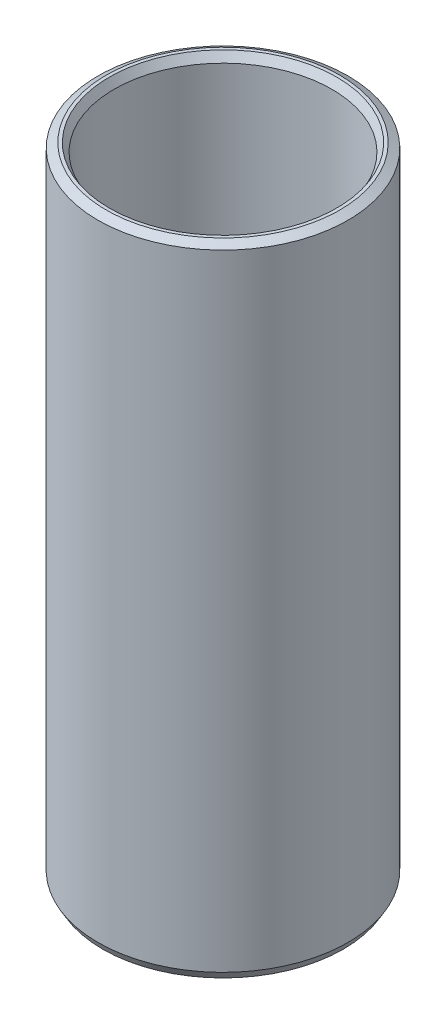
ISO-10303-21;
HEADER;
FILE_DESCRIPTION(('STEP AP214'),'2;1');
FILE_NAME('part.step','',(''),(''),'','','');
FILE_SCHEMA(('AUTOMOTIVE_DESIGN { 1 0 10303 214 1 1 1 1 }'));
ENDSEC;
DATA;
#1=APPLICATION_CONTEXT('core data for automotive mechanical design processes');
#2=APPLICATION_PROTOCOL_DEFINITION('international standard','automotive_design',2000,#1);
#3=PRODUCT_CONTEXT('',#1,'mechanical');
#4=PRODUCT('Part','Part','',(#3));
#5=PRODUCT_RELATED_PRODUCT_CATEGORY('part','',(#4));
#6=PRODUCT_DEFINITION_FORMATION('','',#4);
#7=PRODUCT_DEFINITION_CONTEXT('part definition',#1,'design');
#8=PRODUCT_DEFINITION('design','',#6,#7);
#9=PRODUCT_DEFINITION_SHAPE('','',#8);
#10=(LENGTH_UNIT() NAMED_UNIT(*) SI_UNIT(.MILLI.,.METRE.));
#11=(NAMED_UNIT(*) PLANE_ANGLE_UNIT() SI_UNIT($,.RADIAN.));
#12=(NAMED_UNIT(*) SI_UNIT($,.STERADIAN.) SOLID_ANGLE_UNIT());
#13=UNCERTAINTY_MEASURE_WITH_UNIT(LENGTH_MEASURE(1.E-05),#10,'distance_accuracy_value','');
#14=(GEOMETRIC_REPRESENTATION_CONTEXT(3) GLOBAL_UNCERTAINTY_ASSIGNED_CONTEXT((#13)) GLOBAL_UNIT_ASSIGNED_CONTEXT((#10,
#11,#12)) REPRESENTATION_CONTEXT('',''));
#15=CARTESIAN_POINT('',(0.,0.,0.));
#16=DIRECTION('',(0.,0.,1.));
#17=DIRECTION('',(1.,0.,0.));
#18=AXIS2_PLACEMENT_3D('',#15,#16,#17);
#19=CARTESIAN_POINT('',(0.,217.003758312615,0.));
#20=DIRECTION('',(0.,-1.,0.));
#21=DIRECTION('',(0.,0.,-1.));
#22=AXIS2_PLACEMENT_3D('',#19,#20,#21);
#23=CYLINDRICAL_SURFACE('',#22,42.5);
#24=CARTESIAN_POINT('',(0.,2.7868806564883,0.));
#25=DIRECTION('',(0.,1.,0.));
#26=DIRECTION('',(0.,0.,1.));
#27=AXIS2_PLACEMENT_3D('',#24,#25,#26);
#28=CIRCLE('',#27,42.5);
#29=CARTESIAN_POINT('',(0.,2.7868806564883,42.5));
#30=VERTEX_POINT('',#29);
#31=EDGE_CURVE('E10',#30,#30,#28,.T.);
#32=ORIENTED_EDGE('',*,*,#31,.T.);
#33=EDGE_LOOP('',(#32));
#34=FACE_BOUND('',#33,.T.);
#35=CARTESIAN_POINT('',(0.,215.394752015393,0.));
#36=DIRECTION('',(0.,1.,0.));
#37=DIRECTION('',(0.,0.,1.));
#38=AXIS2_PLACEMENT_3D('',#35,#36,#37);
#39=CIRCLE('',#38,42.5);
#40=CARTESIAN_POINT('',(0.,215.394752015393,-42.5));
#41=VERTEX_POINT('',#40);
#42=EDGE_CURVE('E50',#41,#41,#39,.F.);
#43=ORIENTED_EDGE('',*,*,#42,.T.);
#44=EDGE_LOOP('',(#43));
#45=FACE_BOUND('',#44,.T.);
#46=ADVANCED_FACE('F39',(#34,#45),#23,.T.);
#47=CARTESIAN_POINT('',(0.,217.003758312615,0.));
#48=DIRECTION('',(0.,1.,0.));
#49=DIRECTION('',(0.,0.,1.));
#50=AXIS2_PLACEMENT_3D('',#47,#48,#49);
#51=PLANE('',#50);
#52=CARTESIAN_POINT('',(0.,217.003758312615,0.));
#53=DIRECTION('',(0.,1.,0.));
#54=DIRECTION('',(0.,0.,1.));
#55=AXIS2_PLACEMENT_3D('',#52,#53,#54);
#56=CIRCLE('',#55,38.6212065582993);
#57=CARTESIAN_POINT('',(0.,217.003758312615,38.6212065582993));
#58=VERTEX_POINT('',#57);
#59=EDGE_CURVE('E58',#58,#58,#56,.F.);
#60=ORIENTED_EDGE('',*,*,#59,.T.);
#61=EDGE_LOOP('',(#60));
#62=FACE_BOUND('',#61,.T.);
#63=CARTESIAN_POINT('',(0.,217.003758312615,0.));
#64=DIRECTION('',(0.,1.,0.));
#65=DIRECTION('',(0.,0.,1.));
#66=AXIS2_PLACEMENT_3D('',#63,#64,#65);
#67=CIRCLE('',#66,39.7131193435118);
#68=CARTESIAN_POINT('',(0.,217.003758312615,-39.7131193435118));
#69=VERTEX_POINT('',#68);
#70=EDGE_CURVE('E61',#69,#69,#67,.T.);
#71=ORIENTED_EDGE('',*,*,#70,.T.);
#72=EDGE_LOOP('',(#71));
#73=FACE_BOUND('',#72,.T.);
#74=ADVANCED_FACE('F88',(#62,#73),#51,.T.);
#75=CARTESIAN_POINT('',(0.,0.,0.));
#76=DIRECTION('',(0.,1.,0.));
#77=DIRECTION('',(0.,0.,1.));
#78=AXIS2_PLACEMENT_3D('',#75,#76,#77);
#79=PLANE('',#78);
#80=CARTESIAN_POINT('',(0.,0.,0.));
#81=DIRECTION('',(0.,1.,0.));
#82=DIRECTION('',(0.,0.,1.));
#83=AXIS2_PLACEMENT_3D('',#80,#81,#82);
#84=CIRCLE('',#83,39.7990809175648);
#85=CARTESIAN_POINT('',(0.,0.,39.7990809175648));
#86=VERTEX_POINT('',#85);
#87=EDGE_CURVE('E51',#86,#86,#84,.T.);
#88=ORIENTED_EDGE('',*,*,#87,.T.);
#89=EDGE_LOOP('',(#88));
#90=FACE_BOUND('',#89,.T.);
#91=CARTESIAN_POINT('',(0.,0.,0.));
#92=DIRECTION('',(0.,1.,0.));
#93=DIRECTION('',(0.,0.,1.));
#94=AXIS2_PLACEMENT_3D('',#91,#92,#93);
#95=CIRCLE('',#94,40.8909937027771);
#96=CARTESIAN_POINT('',(0.,0.,40.8909937027771));
#97=VERTEX_POINT('',#96);
#98=EDGE_CURVE('E54',#97,#97,#95,.F.);
#99=ORIENTED_EDGE('',*,*,#98,.T.);
#100=EDGE_LOOP('',(#99));
#101=FACE_BOUND('',#100,.T.);
#102=ADVANCED_FACE('F83',(#90,#101),#79,.F.);
#103=CARTESIAN_POINT('',(0.,217.003758312615,0.));
#104=DIRECTION('',(0.,-1.,0.));
#105=DIRECTION('',(0.,0.,-1.));
#106=AXIS2_PLACEMENT_3D('',#103,#104,#105);
#107=CYLINDRICAL_SURFACE('',#106,37.0122002610765);
#108=CARTESIAN_POINT('',(0.,214.216877656127,0.));
#109=DIRECTION('',(0.,1.,0.));
#110=DIRECTION('',(0.,0.,1.));
#111=AXIS2_PLACEMENT_3D('',#108,#109,#110);
#112=CIRCLE('',#111,37.0122002610765);
#113=CARTESIAN_POINT('',(0.,214.216877656127,37.0122002610765));
#114=VERTEX_POINT('',#113);
#115=EDGE_CURVE('E67',#114,#114,#112,.T.);
#116=ORIENTED_EDGE('',*,*,#115,.T.);
#117=EDGE_LOOP('',(#116));
#118=FACE_BOUND('',#117,.T.);
#119=CARTESIAN_POINT('',(0.,1.60900629722291,0.));
#120=DIRECTION('',(0.,1.,0.));
#121=DIRECTION('',(0.,0.,1.));
#122=AXIS2_PLACEMENT_3D('',#119,#120,#121);
#123=CIRCLE('',#122,37.0122002610765);
#124=CARTESIAN_POINT('',(0.,1.60900629722291,37.0122002610765));
#125=VERTEX_POINT('',#124);
#126=EDGE_CURVE('E69',#125,#125,#123,.F.);
#127=ORIENTED_EDGE('',*,*,#126,.T.);
#128=EDGE_LOOP('',(#127));
#129=FACE_BOUND('',#128,.T.);
#130=ADVANCED_FACE('F71',(#118,#129),#107,.F.);
#131=CARTESIAN_POINT('',(0.,214.216877656127,0.));
#132=DIRECTION('',(0.,1.,0.));
#133=DIRECTION('',(0.,0.,1.));
#134=AXIS2_PLACEMENT_3D('',#131,#132,#133);
#135=CONICAL_SURFACE('',#134,37.0122002610765,0.523598775598298);
#136=CARTESIAN_POINT('',(0.,217.003758312615,38.6212065582993));
#137=CARTESIAN_POINT('',(0.,216.974728305777,38.6044460760365));
#138=CARTESIAN_POINT('',(0.,216.945698298939,38.5876855937738));
#139=CARTESIAN_POINT('',(0.,216.887638285262,38.5541646292483));
#140=CARTESIAN_POINT('',(0.,216.858608278423,38.5374041469856));
#141=CARTESIAN_POINT('',(0.,216.800548264747,38.5038831824601));
#142=CARTESIAN_POINT('',(0.,216.771518257908,38.4871227001974));
#143=CARTESIAN_POINT('',(0.,216.713458244231,38.4536017356719));
#144=CARTESIAN_POINT('',(0.,216.684428237393,38.4368412534092));
#145=CARTESIAN_POINT('',(0.,216.626368223716,38.4033202888837));
#146=CARTESIAN_POINT('',(0.,216.597338216878,38.3865598066209));
#147=CARTESIAN_POINT('',(0.,216.539278203201,38.3530388420955));
#148=CARTESIAN_POINT('',(0.,216.510248196362,38.3362783598327));
#149=CARTESIAN_POINT('',(0.,216.452188182685,38.3027573953073));
#150=CARTESIAN_POINT('',(0.,216.423158175847,38.2859969130445));
#151=CARTESIAN_POINT('',(0.,216.36509816217,38.252475948519));
#152=CARTESIAN_POINT('',(0.,216.336068155332,38.2357154662563));
#153=CARTESIAN_POINT('',(0.,216.278008141655,38.2021945017308));
#154=CARTESIAN_POINT('',(0.,216.248978134817,38.1854340194681));
#155=CARTESIAN_POINT('',(0.,216.19091812114,38.1519130549426));
#156=CARTESIAN_POINT('',(0.,216.161888114301,38.1351525726799));
#157=CARTESIAN_POINT('',(0.,216.103828100624,38.1016316081544));
#158=CARTESIAN_POINT('',(0.,216.074798093786,38.0848711258917));
#159=CARTESIAN_POINT('',(0.,216.016738080109,38.0513501613662));
#160=CARTESIAN_POINT('',(0.,215.987708073271,38.0345896791035));
#161=CARTESIAN_POINT('',(0.,215.929648059594,38.001068714578));
#162=CARTESIAN_POINT('',(0.,215.900618052756,37.9843082323152));
#163=CARTESIAN_POINT('',(0.,215.842558039079,37.9507872677898));
#164=CARTESIAN_POINT('',(0.,215.81352803224,37.934026785527));
#165=CARTESIAN_POINT('',(0.,215.755468018563,37.9005058210016));
#166=CARTESIAN_POINT('',(0.,215.726438011725,37.8837453387388));
#167=CARTESIAN_POINT('',(0.,215.668377998048,37.8502243742133));
#168=CARTESIAN_POINT('',(0.,215.63934799121,37.8334638919506));
#169=CARTESIAN_POINT('',(0.,215.581287977533,37.7999429274251));
#170=CARTESIAN_POINT('',(0.,215.552257970695,37.7831824451624));
#171=CARTESIAN_POINT('',(0.,215.494197957018,37.7496614806369));
#172=CARTESIAN_POINT('',(0.,215.465167950179,37.7329009983742));
#173=CARTESIAN_POINT('',(0.,215.407107936502,37.6993800338487));
#174=CARTESIAN_POINT('',(0.,215.378077929664,37.682619551586));
#175=CARTESIAN_POINT('',(0.,215.320017915987,37.6490985870605));
#176=CARTESIAN_POINT('',(0.,215.290987909149,37.6323381047977));
#177=CARTESIAN_POINT('',(0.,215.232927895472,37.5988171402723));
#178=CARTESIAN_POINT('',(0.,215.203897888633,37.5820566580095));
#179=CARTESIAN_POINT('',(0.,215.145837874957,37.5485356934841));
#180=CARTESIAN_POINT('',(0.,215.116807868118,37.5317752112213));
#181=CARTESIAN_POINT('',(0.,215.058747854441,37.4982542466959));
#182=CARTESIAN_POINT('',(0.,215.029717847603,37.4814937644331));
#183=CARTESIAN_POINT('',(0.,214.971657833926,37.4479727999076));
#184=CARTESIAN_POINT('',(0.,214.942627827088,37.4312123176449));
#185=CARTESIAN_POINT('',(0.,214.884567813411,37.3976913531194));
#186=CARTESIAN_POINT('',(0.,214.855537806572,37.3809308708567));
#187=CARTESIAN_POINT('',(0.,214.797477792896,37.3474099063312));
#188=CARTESIAN_POINT('',(0.,214.768447786057,37.3306494240685));
#189=CARTESIAN_POINT('',(0.,214.71038777238,37.297128459543));
#190=CARTESIAN_POINT('',(0.,214.681357765542,37.2803679772803));
#191=CARTESIAN_POINT('',(0.,214.623297751865,37.2468470127548));
#192=CARTESIAN_POINT('',(0.,214.594267745027,37.2300865304921));
#193=CARTESIAN_POINT('',(0.,214.53620773135,37.1965655659666));
#194=CARTESIAN_POINT('',(0.,214.507177724511,37.1798050837038));
#195=CARTESIAN_POINT('',(0.,214.449117710835,37.1462841191784));
#196=CARTESIAN_POINT('',(0.,214.420087703996,37.1295236369156));
#197=CARTESIAN_POINT('',(0.,214.362027690319,37.0960026723902));
#198=CARTESIAN_POINT('',(0.,214.332997683481,37.0792421901274));
#199=CARTESIAN_POINT('',(0.,214.274937669804,37.0457212256019));
#200=CARTESIAN_POINT('',(0.,214.245907662966,37.0289607433392));
#201=CARTESIAN_POINT('',(0.,214.216877656127,37.0122002610765));
#202=B_SPLINE_CURVE_WITH_KNOTS('',3,(#136,#137,#138,#139,#140,#141,#142,#143,#144,#145,#146,
#147,#148,#149,#150,#151,#152,#153,#154,#155,#156,#157,#158,#159,#160,#161,#162,#163,#164,#165,
#166,#167,#168,#169,#170,#171,#172,#173,#174,#175,#176,#177,#178,#179,#180,#181,#182,#183,#184,
#185,#186,#187,#188,#189,#190,#191,#192,#193,#194,#195,#196,#197,#198,#199,#200,#201),
.UNSPECIFIED.,.F.,.F.,(4,2,2,2,2,2,2,2,2,2,2,2,2,2,2,2,2,2,2,2,2,2,2,2,2,2,2,2,2,2,2,2,4),(0.,
0.100562893576435,0.201125787152873,0.301688680729284,0.402251574305723,0.502814467882134,
0.603377361458569,0.703940255034983,0.804503148611418,0.905066042187829,1.00562893576427,
1.10619182934068,1.20675472291712,1.30731761649353,1.40788051006996,1.50844340364638,
1.60900629722281,1.70956919079925,1.81013208437566,1.9106949779521,2.01125787152851,
2.11182076510495,2.21238365868136,2.31294655225779,2.41350944583421,2.51407233941064,
2.61463523298706,2.71519812656349,2.8157610201399,2.91632391371634,3.01688680729275,
3.11744970086919,3.2180125944456),.UNSPECIFIED.);
#203=EDGE_CURVE('BSEAM77',#58,#114,#202,.T.);
#204=ORIENTED_EDGE('',*,*,#59,.F.);
#205=ORIENTED_EDGE('',*,*,#115,.F.);
#206=ORIENTED_EDGE('',*,*,#203,.T.);
#207=ORIENTED_EDGE('',*,*,#203,.F.);
#208=EDGE_LOOP('',(#204,#206,#205,#207));
#209=FACE_BOUND('',#208,.T.);
#210=ADVANCED_FACE('F77',(#209),#135,.F.);
#211=CARTESIAN_POINT('',(0.,0.,0.));
#212=DIRECTION('',(0.,-1.,0.));
#213=DIRECTION('',(0.,0.,-1.));
#214=AXIS2_PLACEMENT_3D('',#211,#212,#213);
#215=CONICAL_SURFACE('',#214,39.7990809175648,1.04719755119659);
#216=ORIENTED_EDGE('',*,*,#126,.F.);
#217=EDGE_LOOP('',(#216));
#218=FACE_BOUND('',#217,.T.);
#219=ORIENTED_EDGE('',*,*,#87,.F.);
#220=EDGE_LOOP('',(#219));
#221=FACE_BOUND('',#220,.T.);
#222=ADVANCED_FACE('F73',(#218,#221),#215,.F.);
#223=CARTESIAN_POINT('',(0.,2.7868806564883,0.));
#224=DIRECTION('',(0.,1.,0.));
#225=DIRECTION('',(0.,0.,1.));
#226=AXIS2_PLACEMENT_3D('',#223,#224,#225);
#227=CONICAL_SURFACE('',#226,42.5,0.523598775598303);
#228=ORIENTED_EDGE('',*,*,#98,.F.);
#229=EDGE_LOOP('',(#228));
#230=FACE_BOUND('',#229,.T.);
#231=ORIENTED_EDGE('',*,*,#31,.F.);
#232=EDGE_LOOP('',(#231));
#233=FACE_BOUND('',#232,.T.);
#234=ADVANCED_FACE('F76',(#230,#233),#227,.T.);
#235=CARTESIAN_POINT('',(0.,217.003758312615,0.));
#236=DIRECTION('',(0.,-1.,0.));
#237=DIRECTION('',(0.,0.,-1.));
#238=AXIS2_PLACEMENT_3D('',#235,#236,#237);
#239=CONICAL_SURFACE('',#238,39.7131193435118,1.0471975511966);
#240=CARTESIAN_POINT('',(0.,215.394752015393,-42.5));
#241=CARTESIAN_POINT('',(0.,215.411512497655,-42.4709699931616));
#242=CARTESIAN_POINT('',(0.,215.428272979918,-42.4419399863232));
#243=CARTESIAN_POINT('',(0.,215.461793944444,-42.3838799726464));
#244=CARTESIAN_POINT('',(0.,215.478554426706,-42.3548499658079));
#245=CARTESIAN_POINT('',(0.,215.512075391232,-42.2967899521311));
#246=CARTESIAN_POINT('',(0.,215.528835873495,-42.2677599452927));
#247=CARTESIAN_POINT('',(0.,215.56235683802,-42.2096999316158));
#248=CARTESIAN_POINT('',(0.,215.579117320283,-42.1806699247774));
#249=CARTESIAN_POINT('',(0.,215.612638284808,-42.1226099111006));
#250=CARTESIAN_POINT('',(0.,215.629398767071,-42.0935799042622));
#251=CARTESIAN_POINT('',(0.,215.662919731596,-42.0355198905853));
#252=CARTESIAN_POINT('',(0.,215.679680213859,-42.0064898837469));
#253=CARTESIAN_POINT('',(0.,215.713201178385,-41.9484298700701));
#254=CARTESIAN_POINT('',(0.,215.729961660647,-41.9193998632316));
#255=CARTESIAN_POINT('',(0.,215.763482625173,-41.8613398495548));
#256=CARTESIAN_POINT('',(0.,215.780243107436,-41.8323098427164));
#257=CARTESIAN_POINT('',(0.,215.813764071961,-41.7742498290396));
#258=CARTESIAN_POINT('',(0.,215.830524554224,-41.7452198222011));
#259=CARTESIAN_POINT('',(0.,215.864045518749,-41.6871598085243));
#260=CARTESIAN_POINT('',(0.,215.880806001012,-41.6581298016859));
#261=CARTESIAN_POINT('',(0.,215.914326965537,-41.600069788009));
#262=CARTESIAN_POINT('',(0.,215.9310874478,-41.5710397811706));
#263=CARTESIAN_POINT('',(0.,215.964608412326,-41.5129797674938));
#264=CARTESIAN_POINT('',(0.,215.981368894588,-41.4839497606554));
#265=CARTESIAN_POINT('',(0.,216.014889859114,-41.4258897469785));
#266=CARTESIAN_POINT('',(0.,216.031650341377,-41.3968597401401));
#267=CARTESIAN_POINT('',(0.,216.065171305902,-41.3387997264633));
#268=CARTESIAN_POINT('',(0.,216.081931788165,-41.3097697196248));
#269=CARTESIAN_POINT('',(0.,216.11545275269,-41.251709705948));
#270=CARTESIAN_POINT('',(0.,216.132213234953,-41.2226796991096));
#271=CARTESIAN_POINT('',(0.,216.165734199479,-41.1646196854328));
#272=CARTESIAN_POINT('',(0.,216.182494681741,-41.1355896785943));
#273=CARTESIAN_POINT('',(0.,216.216015646267,-41.0775296649175));
#274=CARTESIAN_POINT('',(0.,216.232776128529,-41.0484996580791));
#275=CARTESIAN_POINT('',(0.,216.266297093055,-40.9904396444022));
#276=CARTESIAN_POINT('',(0.,216.283057575318,-40.9614096375638));
#277=CARTESIAN_POINT('',(0.,216.316578539843,-40.903349623887));
#278=CARTESIAN_POINT('',(0.,216.333339022106,-40.8743196170486));
#279=CARTESIAN_POINT('',(0.,216.366859986631,-40.8162596033717));
#280=CARTESIAN_POINT('',(0.,216.383620468894,-40.7872295965333));
#281=CARTESIAN_POINT('',(0.,216.41714143342,-40.7291695828565));
#282=CARTESIAN_POINT('',(0.,216.433901915682,-40.700139576018));
#283=CARTESIAN_POINT('',(0.,216.467422880208,-40.6420795623412));
#284=CARTESIAN_POINT('',(0.,216.484183362471,-40.6130495555028));
#285=CARTESIAN_POINT('',(0.,216.517704326996,-40.554989541826));
#286=CARTESIAN_POINT('',(0.,216.534464809259,-40.5259595349875));
#287=CARTESIAN_POINT('',(0.,216.567985773784,-40.4678995213107));
#288=CARTESIAN_POINT('',(0.,216.584746256047,-40.4388695144723));
#289=CARTESIAN_POINT('',(0.,216.618267220572,-40.3808095007954));
#290=CARTESIAN_POINT('',(0.,216.635027702835,-40.351779493957));
#291=CARTESIAN_POINT('',(0.,216.668548667361,-40.2937194802802));
#292=CARTESIAN_POINT('',(0.,216.685309149623,-40.2646894734417));
#293=CARTESIAN_POINT('',(0.,216.718830114149,-40.2066294597649));
#294=CARTESIAN_POINT('',(0.,216.735590596412,-40.1775994529265));
#295=CARTESIAN_POINT('',(0.,216.769111560937,-40.1195394392497));
#296=CARTESIAN_POINT('',(0.,216.7858720432,-40.0905094324112));
#297=CARTESIAN_POINT('',(0.,216.819393007725,-40.0324494187344));
#298=CARTESIAN_POINT('',(0.,216.836153489988,-40.003419411896));
#299=CARTESIAN_POINT('',(0.,216.869674454514,-39.9453593982191));
#300=CARTESIAN_POINT('',(0.,216.886434936776,-39.9163293913807));
#301=CARTESIAN_POINT('',(0.,216.919955901302,-39.8582693777039));
#302=CARTESIAN_POINT('',(0.,216.936716383564,-39.8292393708655));
#303=CARTESIAN_POINT('',(0.,216.97023734809,-39.7711793571886));
#304=CARTESIAN_POINT('',(0.,216.986997830353,-39.7421493503502));
#305=CARTESIAN_POINT('',(0.,217.003758312615,-39.7131193435118));
#306=B_SPLINE_CURVE_WITH_KNOTS('',3,(#240,#241,#242,#243,#244,#245,#246,#247,#248,#249,#250,
#251,#252,#253,#254,#255,#256,#257,#258,#259,#260,#261,#262,#263,#264,#265,#266,#267,#268,#269,
#270,#271,#272,#273,#274,#275,#276,#277,#278,#279,#280,#281,#282,#283,#284,#285,#286,#287,#288,
#289,#290,#291,#292,#293,#294,#295,#296,#297,#298,#299,#300,#301,#302,#303,#304,#305),
.UNSPECIFIED.,.F.,.F.,(4,2,2,2,2,2,2,2,2,2,2,2,2,2,2,2,2,2,2,2,2,2,2,2,2,2,2,2,2,2,2,2,4),(0.,
0.100562893576439,0.201125787152859,0.301688680729298,0.402251574305718,0.502814467882157,
0.603377361458576,0.703940255035002,0.804503148611435,0.905066042187861,1.00562893576429,
1.10619182934072,1.20675472291714,1.30731761649358,1.40788051007,1.50844340364644,
1.60900629722286,1.70956919079928,1.81013208437572,1.91069497795214,2.01125787152857,
2.111820765105,2.21238365868142,2.31294655225786,2.41350944583428,2.51407233941072,
2.61463523298714,2.71519812656356,2.81576102014,2.91632391371642,3.01688680729286,
3.11744970086928,3.21801259444572),.UNSPECIFIED.);
#307=EDGE_CURVE('BSEAM45',#41,#69,#306,.T.);
#308=ORIENTED_EDGE('',*,*,#42,.F.);
#309=ORIENTED_EDGE('',*,*,#70,.F.);
#310=ORIENTED_EDGE('',*,*,#307,.T.);
#311=ORIENTED_EDGE('',*,*,#307,.F.);
#312=EDGE_LOOP('',(#308,#310,#309,#311));
#313=FACE_BOUND('',#312,.T.);
#314=ADVANCED_FACE('F45',(#313),#239,.T.);
#315=CLOSED_SHELL('',(#46,#74,#102,#130,#210,#222,#234,#314));
#316=MANIFOLD_SOLID_BREP('B2',#315);
#317=ADVANCED_BREP_SHAPE_REPRESENTATION('',(#18,#316),#14);
#318=SHAPE_DEFINITION_REPRESENTATION(#9,#317);
ENDSEC;
END-ISO-10303-21;
